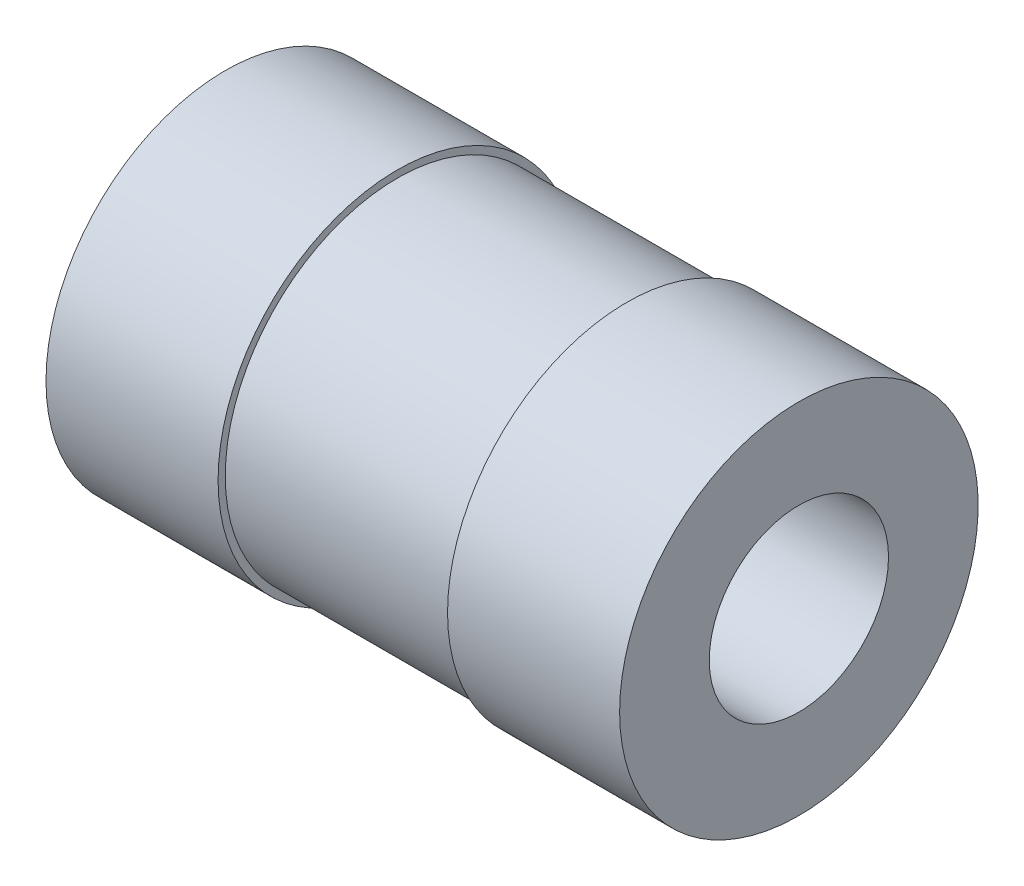
ISO-10303-21;
HEADER;
FILE_DESCRIPTION(('STEP AP214'),'2;1');
FILE_NAME('part.step','',(''),(''),'','','');
FILE_SCHEMA(('AUTOMOTIVE_DESIGN { 1 0 10303 214 1 1 1 1 }'));
ENDSEC;
DATA;
#1=APPLICATION_CONTEXT('core data for automotive mechanical design processes');
#2=APPLICATION_PROTOCOL_DEFINITION('international standard','automotive_design',2000,#1);
#3=PRODUCT_CONTEXT('',#1,'mechanical');
#4=PRODUCT('Part','Part','',(#3));
#5=PRODUCT_RELATED_PRODUCT_CATEGORY('part','',(#4));
#6=PRODUCT_DEFINITION_FORMATION('','',#4);
#7=PRODUCT_DEFINITION_CONTEXT('part definition',#1,'design');
#8=PRODUCT_DEFINITION('design','',#6,#7);
#9=PRODUCT_DEFINITION_SHAPE('','',#8);
#10=(LENGTH_UNIT() NAMED_UNIT(*) SI_UNIT(.MILLI.,.METRE.));
#11=(NAMED_UNIT(*) PLANE_ANGLE_UNIT() SI_UNIT($,.RADIAN.));
#12=(NAMED_UNIT(*) SI_UNIT($,.STERADIAN.) SOLID_ANGLE_UNIT());
#13=UNCERTAINTY_MEASURE_WITH_UNIT(LENGTH_MEASURE(1.E-05),#10,'distance_accuracy_value','');
#14=(GEOMETRIC_REPRESENTATION_CONTEXT(3) GLOBAL_UNCERTAINTY_ASSIGNED_CONTEXT((#13)) GLOBAL_UNIT_ASSIGNED_CONTEXT((#10,
#11,#12)) REPRESENTATION_CONTEXT('',''));
#15=CARTESIAN_POINT('',(0.,0.,0.));
#16=DIRECTION('',(0.,0.,1.));
#17=DIRECTION('',(1.,0.,0.));
#18=AXIS2_PLACEMENT_3D('',#15,#16,#17);
#19=CARTESIAN_POINT('',(-4.,2.5,0.));
#20=DIRECTION('',(1.,0.,0.));
#21=DIRECTION('',(0.,0.,-1.));
#22=AXIS2_PLACEMENT_3D('',#19,#20,#21);
#23=PLANE('',#22);
#24=CARTESIAN_POINT('',(-4.,0.,0.));
#25=DIRECTION('',(-1.,0.,0.));
#26=DIRECTION('',(0.,0.,1.));
#27=AXIS2_PLACEMENT_3D('',#24,#25,#26);
#28=CIRCLE('',#27,1.25);
#29=CARTESIAN_POINT('',(-4.,0.,1.25));
#30=VERTEX_POINT('',#29);
#31=EDGE_CURVE('E10',#30,#30,#28,.T.);
#32=ORIENTED_EDGE('',*,*,#31,.F.);
#33=EDGE_LOOP('',(#32));
#34=FACE_BOUND('',#33,.T.);
#35=CARTESIAN_POINT('',(-4.,0.,0.));
#36=DIRECTION('',(-1.,0.,0.));
#37=DIRECTION('',(0.,0.,1.));
#38=AXIS2_PLACEMENT_3D('',#35,#36,#37);
#39=CIRCLE('',#38,2.5);
#40=CARTESIAN_POINT('',(-4.,0.,2.5));
#41=VERTEX_POINT('',#40);
#42=EDGE_CURVE('E64',#41,#41,#39,.T.);
#43=ORIENTED_EDGE('',*,*,#42,.T.);
#44=EDGE_LOOP('',(#43));
#45=FACE_BOUND('',#44,.T.);
#46=ADVANCED_FACE('F36',(#34,#45),#23,.F.);
#47=CARTESIAN_POINT('',(-2.02262443438914,0.,0.));
#48=DIRECTION('',(-1.,0.,0.));
#49=DIRECTION('',(0.,0.,1.));
#50=AXIS2_PLACEMENT_3D('',#47,#48,#49);
#51=CYLINDRICAL_SURFACE('',#50,1.25);
#52=CARTESIAN_POINT('',(4.,0.,0.));
#53=DIRECTION('',(-1.,0.,0.));
#54=DIRECTION('',(0.,0.,1.));
#55=AXIS2_PLACEMENT_3D('',#52,#53,#54);
#56=CIRCLE('',#55,1.25);
#57=CARTESIAN_POINT('',(4.,0.,1.25));
#58=VERTEX_POINT('',#57);
#59=EDGE_CURVE('E42',#58,#58,#56,.T.);
#60=ORIENTED_EDGE('',*,*,#59,.F.);
#61=EDGE_LOOP('',(#60));
#62=FACE_BOUND('',#61,.T.);
#63=ORIENTED_EDGE('',*,*,#31,.T.);
#64=EDGE_LOOP('',(#63));
#65=FACE_BOUND('',#64,.T.);
#66=ADVANCED_FACE('F101',(#62,#65),#51,.F.);
#67=CARTESIAN_POINT('',(4.,1.25,0.));
#68=DIRECTION('',(-1.,0.,0.));
#69=DIRECTION('',(0.,0.,1.));
#70=AXIS2_PLACEMENT_3D('',#67,#68,#69);
#71=PLANE('',#70);
#72=CARTESIAN_POINT('',(4.,0.,0.));
#73=DIRECTION('',(-1.,0.,0.));
#74=DIRECTION('',(0.,0.,1.));
#75=AXIS2_PLACEMENT_3D('',#72,#73,#74);
#76=CIRCLE('',#75,2.5);
#77=CARTESIAN_POINT('',(4.,0.,2.5));
#78=VERTEX_POINT('',#77);
#79=EDGE_CURVE('E46',#78,#78,#76,.T.);
#80=ORIENTED_EDGE('',*,*,#79,.F.);
#81=EDGE_LOOP('',(#80));
#82=FACE_BOUND('',#81,.T.);
#83=ORIENTED_EDGE('',*,*,#59,.T.);
#84=EDGE_LOOP('',(#83));
#85=FACE_BOUND('',#84,.T.);
#86=ADVANCED_FACE('F96',(#82,#85),#71,.F.);
#87=CARTESIAN_POINT('',(-2.02262443438914,0.,0.));
#88=DIRECTION('',(-1.,0.,0.));
#89=DIRECTION('',(0.,0.,1.));
#90=AXIS2_PLACEMENT_3D('',#87,#88,#89);
#91=CYLINDRICAL_SURFACE('',#90,2.5);
#92=CARTESIAN_POINT('',(1.6,0.,0.));
#93=DIRECTION('',(-1.,0.,0.));
#94=DIRECTION('',(0.,0.,1.));
#95=AXIS2_PLACEMENT_3D('',#92,#93,#94);
#96=CIRCLE('',#95,2.5);
#97=CARTESIAN_POINT('',(1.6,0.,2.5));
#98=VERTEX_POINT('',#97);
#99=EDGE_CURVE('E50',#98,#98,#96,.T.);
#100=ORIENTED_EDGE('',*,*,#99,.F.);
#101=EDGE_LOOP('',(#100));
#102=FACE_BOUND('',#101,.T.);
#103=ORIENTED_EDGE('',*,*,#79,.T.);
#104=EDGE_LOOP('',(#103));
#105=FACE_BOUND('',#104,.T.);
#106=ADVANCED_FACE('F90',(#102,#105),#91,.T.);
#107=CARTESIAN_POINT('',(1.6,2.5,0.));
#108=DIRECTION('',(1.,0.,0.));
#109=DIRECTION('',(0.,0.,-1.));
#110=AXIS2_PLACEMENT_3D('',#107,#108,#109);
#111=PLANE('',#110);
#112=CARTESIAN_POINT('',(1.6,0.,0.));
#113=DIRECTION('',(-1.,0.,0.));
#114=DIRECTION('',(0.,0.,1.));
#115=AXIS2_PLACEMENT_3D('',#112,#113,#114);
#116=CIRCLE('',#115,2.4);
#117=CARTESIAN_POINT('',(1.6,0.,2.4));
#118=VERTEX_POINT('',#117);
#119=EDGE_CURVE('E55',#118,#118,#116,.T.);
#120=ORIENTED_EDGE('',*,*,#119,.F.);
#121=EDGE_LOOP('',(#120));
#122=FACE_BOUND('',#121,.T.);
#123=ORIENTED_EDGE('',*,*,#99,.T.);
#124=EDGE_LOOP('',(#123));
#125=FACE_BOUND('',#124,.T.);
#126=ADVANCED_FACE('F84',(#122,#125),#111,.F.);
#127=CARTESIAN_POINT('',(-2.02262443438914,0.,0.));
#128=DIRECTION('',(-1.,0.,0.));
#129=DIRECTION('',(0.,0.,1.));
#130=AXIS2_PLACEMENT_3D('',#127,#128,#129);
#131=CYLINDRICAL_SURFACE('',#130,2.4);
#132=CARTESIAN_POINT('',(-1.6,0.,0.));
#133=DIRECTION('',(-1.,0.,0.));
#134=DIRECTION('',(0.,0.,1.));
#135=AXIS2_PLACEMENT_3D('',#132,#133,#134);
#136=CIRCLE('',#135,2.4);
#137=CARTESIAN_POINT('',(-1.6,0.,2.4));
#138=VERTEX_POINT('',#137);
#139=EDGE_CURVE('E58',#138,#138,#136,.T.);
#140=ORIENTED_EDGE('',*,*,#139,.F.);
#141=EDGE_LOOP('',(#140));
#142=FACE_BOUND('',#141,.T.);
#143=ORIENTED_EDGE('',*,*,#119,.T.);
#144=EDGE_LOOP('',(#143));
#145=FACE_BOUND('',#144,.T.);
#146=ADVANCED_FACE('F78',(#142,#145),#131,.T.);
#147=CARTESIAN_POINT('',(-1.6,2.4,0.));
#148=DIRECTION('',(-1.,0.,0.));
#149=DIRECTION('',(0.,0.,1.));
#150=AXIS2_PLACEMENT_3D('',#147,#148,#149);
#151=PLANE('',#150);
#152=CARTESIAN_POINT('',(-1.6,0.,0.));
#153=DIRECTION('',(-1.,0.,0.));
#154=DIRECTION('',(0.,0.,1.));
#155=AXIS2_PLACEMENT_3D('',#152,#153,#154);
#156=CIRCLE('',#155,2.5);
#157=CARTESIAN_POINT('',(-1.6,0.,2.5));
#158=VERTEX_POINT('',#157);
#159=EDGE_CURVE('E61',#158,#158,#156,.T.);
#160=ORIENTED_EDGE('',*,*,#159,.F.);
#161=EDGE_LOOP('',(#160));
#162=FACE_BOUND('',#161,.T.);
#163=ORIENTED_EDGE('',*,*,#139,.T.);
#164=EDGE_LOOP('',(#163));
#165=FACE_BOUND('',#164,.T.);
#166=ADVANCED_FACE('F72',(#162,#165),#151,.F.);
#167=CARTESIAN_POINT('',(-2.02262443438914,0.,0.));
#168=DIRECTION('',(-1.,0.,0.));
#169=DIRECTION('',(0.,0.,1.));
#170=AXIS2_PLACEMENT_3D('',#167,#168,#169);
#171=CYLINDRICAL_SURFACE('',#170,2.5);
#172=ORIENTED_EDGE('',*,*,#42,.F.);
#173=EDGE_LOOP('',(#172));
#174=FACE_BOUND('',#173,.T.);
#175=ORIENTED_EDGE('',*,*,#159,.T.);
#176=EDGE_LOOP('',(#175));
#177=FACE_BOUND('',#176,.T.);
#178=ADVANCED_FACE('F69',(#174,#177),#171,.T.);
#179=CLOSED_SHELL('',(#46,#66,#86,#106,#126,#146,#166,#178));
#180=MANIFOLD_SOLID_BREP('B2',#179);
#181=ADVANCED_BREP_SHAPE_REPRESENTATION('',(#18,#180),#14);
#182=SHAPE_DEFINITION_REPRESENTATION(#9,#181);
ENDSEC;
END-ISO-10303-21;
